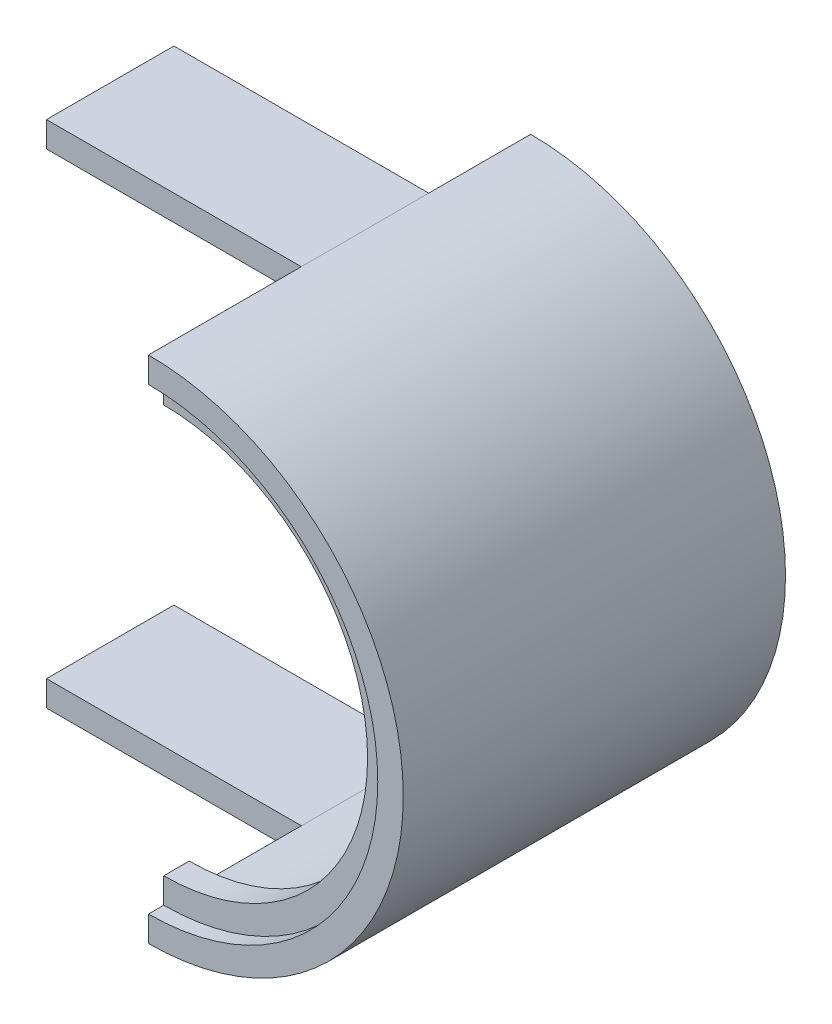
ISO-10303-21;
HEADER;
FILE_DESCRIPTION(('STEP AP214'),'2;1');
FILE_NAME('part.step','',(''),(''),'','','');
FILE_SCHEMA(('AUTOMOTIVE_DESIGN { 1 0 10303 214 1 1 1 1 }'));
ENDSEC;
DATA;
#1=APPLICATION_CONTEXT('core data for automotive mechanical design processes');
#2=APPLICATION_PROTOCOL_DEFINITION('international standard','automotive_design',2000,#1);
#3=PRODUCT_CONTEXT('',#1,'mechanical');
#4=PRODUCT('Part','Part','',(#3));
#5=PRODUCT_RELATED_PRODUCT_CATEGORY('part','',(#4));
#6=PRODUCT_DEFINITION_FORMATION('','',#4);
#7=PRODUCT_DEFINITION_CONTEXT('part definition',#1,'design');
#8=PRODUCT_DEFINITION('design','',#6,#7);
#9=PRODUCT_DEFINITION_SHAPE('','',#8);
#10=(LENGTH_UNIT() NAMED_UNIT(*) SI_UNIT(.MILLI.,.METRE.));
#11=(NAMED_UNIT(*) PLANE_ANGLE_UNIT() SI_UNIT($,.RADIAN.));
#12=(NAMED_UNIT(*) SI_UNIT($,.STERADIAN.) SOLID_ANGLE_UNIT());
#13=UNCERTAINTY_MEASURE_WITH_UNIT(LENGTH_MEASURE(1.E-05),#10,'distance_accuracy_value','');
#14=(GEOMETRIC_REPRESENTATION_CONTEXT(3) GLOBAL_UNCERTAINTY_ASSIGNED_CONTEXT((#13)) GLOBAL_UNIT_ASSIGNED_CONTEXT((#10,
#11,#12)) REPRESENTATION_CONTEXT('',''));
#15=CARTESIAN_POINT('',(0.,0.,0.));
#16=DIRECTION('',(0.,0.,1.));
#17=DIRECTION('',(1.,0.,0.));
#18=AXIS2_PLACEMENT_3D('',#15,#16,#17);
#19=CARTESIAN_POINT('',(597.266258042068,0.,0.));
#20=DIRECTION('',(1.,0.,0.));
#21=DIRECTION('',(0.,0.,-1.));
#22=AXIS2_PLACEMENT_3D('',#19,#20,#21);
#23=PLANE('',#22);
#24=DIRECTION('',(0.,-1.,0.));
#25=VECTOR('',#24,1.);
#26=CARTESIAN_POINT('',(597.266258042068,50.,25.));
#27=LINE('',#26,#25);
#28=CARTESIAN_POINT('',(597.266258042068,50.,25.));
#29=VERTEX_POINT('',#28);
#30=CARTESIAN_POINT('',(597.266258042068,45.,25.));
#31=VERTEX_POINT('',#30);
#32=EDGE_CURVE('E56',#29,#31,#27,.T.);
#33=ORIENTED_EDGE('',*,*,#32,.F.);
#34=DIRECTION('',(0.,0.,-1.));
#35=VECTOR('',#34,1.);
#36=CARTESIAN_POINT('',(597.266258042068,50.,80.));
#37=LINE('',#36,#35);
#38=CARTESIAN_POINT('',(597.266258042068,50.,5.));
#39=VERTEX_POINT('',#38);
#40=EDGE_CURVE('E48',#29,#39,#37,.T.);
#41=ORIENTED_EDGE('',*,*,#40,.T.);
#42=DIRECTION('',(0.,-1.,0.));
#43=VECTOR('',#42,1.);
#44=CARTESIAN_POINT('',(597.266258042068,0.,5.));
#45=LINE('',#44,#43);
#46=CARTESIAN_POINT('',(597.266258042068,45.,5.));
#47=VERTEX_POINT('',#46);
#48=EDGE_CURVE('E220',#39,#47,#45,.T.);
#49=ORIENTED_EDGE('',*,*,#48,.T.);
#50=DIRECTION('',(0.,0.,-1.));
#51=VECTOR('',#50,1.);
#52=CARTESIAN_POINT('',(597.266258042068,45.,80.));
#53=LINE('',#52,#51);
#54=EDGE_CURVE('E233',#31,#47,#53,.T.);
#55=ORIENTED_EDGE('',*,*,#54,.F.);
#56=EDGE_LOOP('',(#33,#41,#49,#55));
#57=FACE_BOUND('',#56,.T.);
#58=ADVANCED_FACE('F39',(#57),#23,.F.);
#59=DIRECTION('',(0.,1.,0.));
#60=VECTOR('',#59,1.);
#61=CARTESIAN_POINT('',(597.266258042068,50.,50.));
#62=LINE('',#61,#60);
#63=CARTESIAN_POINT('',(597.266258042068,45.,50.));
#64=VERTEX_POINT('',#63);
#65=CARTESIAN_POINT('',(597.266258042068,50.,50.));
#66=VERTEX_POINT('',#65);
#67=EDGE_CURVE('E283',#64,#66,#62,.T.);
#68=ORIENTED_EDGE('',*,*,#67,.F.);
#69=CARTESIAN_POINT('',(597.266258042068,45.,72.));
#70=VERTEX_POINT('',#69);
#71=EDGE_CURVE('E229',#70,#64,#53,.T.);
#72=ORIENTED_EDGE('',*,*,#71,.F.);
#73=DIRECTION('',(0.,-1.,0.));
#74=VECTOR('',#73,1.);
#75=CARTESIAN_POINT('',(597.266258042068,0.,72.));
#76=LINE('',#75,#74);
#77=CARTESIAN_POINT('',(597.266258042068,40.,72.));
#78=VERTEX_POINT('',#77);
#79=EDGE_CURVE('E232',#70,#78,#76,.T.);
#80=ORIENTED_EDGE('',*,*,#79,.T.);
#81=DIRECTION('',(0.,0.,1.));
#82=VECTOR('',#81,1.);
#83=CARTESIAN_POINT('',(597.266258042068,40.,4.99000000000001));
#84=LINE('',#83,#82);
#85=CARTESIAN_POINT('',(597.266258042068,40.,77.));
#86=VERTEX_POINT('',#85);
#87=EDGE_CURVE('E242',#86,#78,#84,.F.);
#88=ORIENTED_EDGE('',*,*,#87,.F.);
#89=DIRECTION('',(0.,-1.,0.));
#90=VECTOR('',#89,1.);
#91=CARTESIAN_POINT('',(597.266258042068,0.,77.));
#92=LINE('',#91,#90);
#93=CARTESIAN_POINT('',(597.266258042068,45.,77.));
#94=VERTEX_POINT('',#93);
#95=EDGE_CURVE('E249',#94,#86,#92,.T.);
#96=ORIENTED_EDGE('',*,*,#95,.F.);
#97=DIRECTION('',(0.,0.,-1.));
#98=VECTOR('',#97,1.);
#99=CARTESIAN_POINT('',(597.266258042068,45.,80.));
#100=LINE('',#99,#98);
#101=CARTESIAN_POINT('',(597.266258042068,45.,80.));
#102=VERTEX_POINT('',#101);
#103=EDGE_CURVE('E260',#102,#94,#100,.T.);
#104=ORIENTED_EDGE('',*,*,#103,.F.);
#105=DIRECTION('',(0.,1.,0.));
#106=VECTOR('',#105,1.);
#107=CARTESIAN_POINT('',(597.266258042068,0.,80.));
#108=LINE('',#107,#106);
#109=CARTESIAN_POINT('',(597.266258042068,50.,80.));
#110=VERTEX_POINT('',#109);
#111=EDGE_CURVE('E252',#102,#110,#108,.T.);
#112=ORIENTED_EDGE('',*,*,#111,.T.);
#113=EDGE_CURVE('E12',#110,#66,#37,.T.);
#114=ORIENTED_EDGE('',*,*,#113,.T.);
#115=EDGE_LOOP('',(#68,#72,#80,#88,#96,#104,#112,#114));
#116=FACE_BOUND('',#115,.T.);
#117=ADVANCED_FACE('F287',(#116),#23,.F.);
#118=DIRECTION('',(0.,-1.,0.));
#119=VECTOR('',#118,1.);
#120=CARTESIAN_POINT('',(597.266258042068,-45.,25.));
#121=LINE('',#120,#119);
#122=CARTESIAN_POINT('',(597.266258042068,-45.,25.));
#123=VERTEX_POINT('',#122);
#124=CARTESIAN_POINT('',(597.266258042068,-50.,25.));
#125=VERTEX_POINT('',#124);
#126=EDGE_CURVE('E176',#123,#125,#121,.T.);
#127=ORIENTED_EDGE('',*,*,#126,.F.);
#128=DIRECTION('',(0.,0.,-1.));
#129=VECTOR('',#128,1.);
#130=CARTESIAN_POINT('',(597.266258042068,-45.,80.));
#131=LINE('',#130,#129);
#132=CARTESIAN_POINT('',(597.266258042068,-45.,5.));
#133=VERTEX_POINT('',#132);
#134=EDGE_CURVE('E218',#123,#133,#131,.T.);
#135=ORIENTED_EDGE('',*,*,#134,.T.);
#136=CARTESIAN_POINT('',(597.266258042068,-50.,5.));
#137=VERTEX_POINT('',#136);
#138=EDGE_CURVE('E219',#133,#137,#45,.T.);
#139=ORIENTED_EDGE('',*,*,#138,.T.);
#140=DIRECTION('',(0.,0.,-1.));
#141=VECTOR('',#140,1.);
#142=CARTESIAN_POINT('',(597.266258042068,-50.,80.));
#143=LINE('',#142,#141);
#144=EDGE_CURVE('E64',#125,#137,#143,.T.);
#145=ORIENTED_EDGE('',*,*,#144,.F.);
#146=EDGE_LOOP('',(#127,#135,#139,#145));
#147=FACE_BOUND('',#146,.T.);
#148=ADVANCED_FACE('F41',(#147),#23,.F.);
#149=DIRECTION('',(0.,1.,0.));
#150=VECTOR('',#149,1.);
#151=CARTESIAN_POINT('',(597.266258042068,-45.,50.));
#152=LINE('',#151,#150);
#153=CARTESIAN_POINT('',(597.266258042068,-50.,50.));
#154=VERTEX_POINT('',#153);
#155=CARTESIAN_POINT('',(597.266258042068,-45.,50.));
#156=VERTEX_POINT('',#155);
#157=EDGE_CURVE('E198',#154,#156,#152,.T.);
#158=ORIENTED_EDGE('',*,*,#157,.F.);
#159=CARTESIAN_POINT('',(597.266258042068,-50.,80.));
#160=VERTEX_POINT('',#159);
#161=EDGE_CURVE('E266',#160,#154,#143,.T.);
#162=ORIENTED_EDGE('',*,*,#161,.F.);
#163=CARTESIAN_POINT('',(597.266258042068,-45.,80.));
#164=VERTEX_POINT('',#163);
#165=EDGE_CURVE('E255',#160,#164,#108,.T.);
#166=ORIENTED_EDGE('',*,*,#165,.T.);
#167=DIRECTION('',(0.,0.,-1.));
#168=VECTOR('',#167,1.);
#169=CARTESIAN_POINT('',(597.266258042068,-45.,80.));
#170=LINE('',#169,#168);
#171=CARTESIAN_POINT('',(597.266258042068,-45.,77.));
#172=VERTEX_POINT('',#171);
#173=EDGE_CURVE('E256',#164,#172,#170,.T.);
#174=ORIENTED_EDGE('',*,*,#173,.T.);
#175=CARTESIAN_POINT('',(597.266258042068,-40.,77.));
#176=VERTEX_POINT('',#175);
#177=EDGE_CURVE('E251',#176,#172,#92,.T.);
#178=ORIENTED_EDGE('',*,*,#177,.F.);
#179=DIRECTION('',(0.,0.,1.));
#180=VECTOR('',#179,1.);
#181=CARTESIAN_POINT('',(597.266258042068,-40.,4.99000000000001));
#182=LINE('',#181,#180);
#183=CARTESIAN_POINT('',(597.266258042068,-40.,72.));
#184=VERTEX_POINT('',#183);
#185=EDGE_CURVE('E214',#184,#176,#182,.T.);
#186=ORIENTED_EDGE('',*,*,#185,.F.);
#187=CARTESIAN_POINT('',(597.266258042068,-45.,72.));
#188=VERTEX_POINT('',#187);
#189=EDGE_CURVE('E248',#184,#188,#76,.T.);
#190=ORIENTED_EDGE('',*,*,#189,.T.);
#191=EDGE_CURVE('E234',#188,#156,#131,.T.);
#192=ORIENTED_EDGE('',*,*,#191,.T.);
#193=EDGE_LOOP('',(#158,#162,#166,#174,#178,#186,#190,#192));
#194=FACE_BOUND('',#193,.T.);
#195=ADVANCED_FACE('F297',(#194),#23,.F.);
#196=CARTESIAN_POINT('',(-502.733741957931,0.,80.));
#197=DIRECTION('',(0.,0.,1.));
#198=DIRECTION('',(1.,0.,0.));
#199=AXIS2_PLACEMENT_3D('',#196,#197,#198);
#200=PLANE('',#199);
#201=ORIENTED_EDGE('',*,*,#165,.F.);
#202=CARTESIAN_POINT('',(597.266258042068,0.,80.));
#203=DIRECTION('',(0.,0.,1.));
#204=DIRECTION('',(1.,0.,0.));
#205=AXIS2_PLACEMENT_3D('',#202,#203,#204);
#206=CIRCLE('',#205,50.);
#207=EDGE_CURVE('E257',#160,#110,#206,.T.);
#208=ORIENTED_EDGE('',*,*,#207,.T.);
#209=ORIENTED_EDGE('',*,*,#111,.F.);
#210=CARTESIAN_POINT('',(597.266258042068,0.,80.));
#211=DIRECTION('',(0.,0.,1.));
#212=DIRECTION('',(1.,0.,0.));
#213=AXIS2_PLACEMENT_3D('',#210,#211,#212);
#214=CIRCLE('',#213,45.);
#215=EDGE_CURVE('E261',#164,#102,#214,.T.);
#216=ORIENTED_EDGE('',*,*,#215,.F.);
#217=EDGE_LOOP('',(#201,#208,#209,#216));
#218=FACE_BOUND('',#217,.T.);
#219=ADVANCED_FACE('F294',(#218),#200,.T.);
#220=CARTESIAN_POINT('',(597.266258042068,0.,80.));
#221=DIRECTION('',(0.,0.,-1.));
#222=DIRECTION('',(-1.,0.,0.));
#223=AXIS2_PLACEMENT_3D('',#220,#221,#222);
#224=CYLINDRICAL_SURFACE('',#223,50.);
#225=ORIENTED_EDGE('',*,*,#161,.T.);
#226=DIRECTION('',(0.,0.,1.));
#227=VECTOR('',#226,1.);
#228=CARTESIAN_POINT('',(597.266258042068,-50.,25.));
#229=LINE('',#228,#227);
#230=EDGE_CURVE('E179',#125,#154,#229,.T.);
#231=ORIENTED_EDGE('',*,*,#230,.F.);
#232=ORIENTED_EDGE('',*,*,#144,.T.);
#233=CARTESIAN_POINT('',(597.266258042068,0.,5.));
#234=DIRECTION('',(0.,0.,1.));
#235=DIRECTION('',(1.,0.,0.));
#236=AXIS2_PLACEMENT_3D('',#233,#234,#235);
#237=CIRCLE('',#236,50.);
#238=EDGE_CURVE('E215',#137,#39,#237,.T.);
#239=ORIENTED_EDGE('',*,*,#238,.T.);
#240=ORIENTED_EDGE('',*,*,#40,.F.);
#241=DIRECTION('',(0.,0.,-1.));
#242=VECTOR('',#241,1.);
#243=CARTESIAN_POINT('',(597.266258042068,50.,25.));
#244=LINE('',#243,#242);
#245=EDGE_CURVE('E173',#66,#29,#244,.T.);
#246=ORIENTED_EDGE('',*,*,#245,.F.);
#247=ORIENTED_EDGE('',*,*,#113,.F.);
#248=ORIENTED_EDGE('',*,*,#207,.F.);
#249=EDGE_LOOP('',(#225,#231,#232,#239,#240,#246,#247,#248));
#250=FACE_BOUND('',#249,.T.);
#251=ADVANCED_FACE('F270',(#250),#224,.T.);
#252=CARTESIAN_POINT('',(597.266258042068,0.,80.));
#253=DIRECTION('',(0.,0.,-1.));
#254=DIRECTION('',(-1.,0.,0.));
#255=AXIS2_PLACEMENT_3D('',#252,#253,#254);
#256=CYLINDRICAL_SURFACE('',#255,45.);
#257=CARTESIAN_POINT('',(597.266258042068,0.,77.));
#258=DIRECTION('',(0.,0.,1.));
#259=DIRECTION('',(1.,0.,0.));
#260=AXIS2_PLACEMENT_3D('',#257,#258,#259);
#261=CIRCLE('',#260,45.);
#262=EDGE_CURVE('E43',#172,#94,#261,.T.);
#263=ORIENTED_EDGE('',*,*,#262,.F.);
#264=ORIENTED_EDGE('',*,*,#173,.F.);
#265=ORIENTED_EDGE('',*,*,#215,.T.);
#266=ORIENTED_EDGE('',*,*,#103,.T.);
#267=EDGE_LOOP('',(#263,#264,#265,#266));
#268=FACE_BOUND('',#267,.T.);
#269=ADVANCED_FACE('F342',(#268),#256,.F.);
#270=CARTESIAN_POINT('',(597.266258042068,-45.,77.));
#271=DIRECTION('',(0.,0.,1.));
#272=DIRECTION('',(1.,0.,0.));
#273=AXIS2_PLACEMENT_3D('',#270,#271,#272);
#274=PLANE('',#273);
#275=ORIENTED_EDGE('',*,*,#177,.T.);
#276=ORIENTED_EDGE('',*,*,#262,.T.);
#277=ORIENTED_EDGE('',*,*,#95,.T.);
#278=CARTESIAN_POINT('',(597.266258042068,0.,77.));
#279=DIRECTION('',(0.,0.,1.));
#280=DIRECTION('',(1.,0.,0.));
#281=AXIS2_PLACEMENT_3D('',#278,#279,#280);
#282=CIRCLE('',#281,40.);
#283=EDGE_CURVE('E228',#86,#176,#282,.F.);
#284=ORIENTED_EDGE('',*,*,#283,.T.);
#285=EDGE_LOOP('',(#275,#276,#277,#284));
#286=FACE_BOUND('',#285,.T.);
#287=ADVANCED_FACE('F331',(#286),#274,.T.);
#288=CARTESIAN_POINT('',(597.266258042068,0.,4.99000000000001));
#289=DIRECTION('',(0.,0.,1.));
#290=DIRECTION('',(1.,0.,0.));
#291=AXIS2_PLACEMENT_3D('',#288,#289,#290);
#292=CYLINDRICAL_SURFACE('',#291,40.);
#293=ORIENTED_EDGE('',*,*,#87,.T.);
#294=CARTESIAN_POINT('',(597.266258042068,0.,72.));
#295=DIRECTION('',(0.,0.,1.));
#296=DIRECTION('',(1.,0.,0.));
#297=AXIS2_PLACEMENT_3D('',#294,#295,#296);
#298=CIRCLE('',#297,40.);
#299=EDGE_CURVE('E239',#78,#184,#298,.F.);
#300=ORIENTED_EDGE('',*,*,#299,.T.);
#301=ORIENTED_EDGE('',*,*,#185,.T.);
#302=ORIENTED_EDGE('',*,*,#283,.F.);
#303=EDGE_LOOP('',(#293,#300,#301,#302));
#304=FACE_BOUND('',#303,.T.);
#305=ADVANCED_FACE('F320',(#304),#292,.F.);
#306=CARTESIAN_POINT('',(597.266258042068,-45.,5.));
#307=DIRECTION('',(0.,0.,1.));
#308=DIRECTION('',(1.,0.,0.));
#309=AXIS2_PLACEMENT_3D('',#306,#307,#308);
#310=PLANE('',#309);
#311=ORIENTED_EDGE('',*,*,#238,.F.);
#312=ORIENTED_EDGE('',*,*,#138,.F.);
#313=CARTESIAN_POINT('',(597.266258042068,0.,5.));
#314=DIRECTION('',(0.,0.,1.));
#315=DIRECTION('',(1.,0.,0.));
#316=AXIS2_PLACEMENT_3D('',#313,#314,#315);
#317=CIRCLE('',#316,45.);
#318=EDGE_CURVE('E223',#133,#47,#317,.T.);
#319=ORIENTED_EDGE('',*,*,#318,.T.);
#320=ORIENTED_EDGE('',*,*,#48,.F.);
#321=EDGE_LOOP('',(#311,#312,#319,#320));
#322=FACE_BOUND('',#321,.T.);
#323=ADVANCED_FACE('F277',(#322),#310,.F.);
#324=CARTESIAN_POINT('',(597.266258042068,0.,80.));
#325=DIRECTION('',(0.,0.,-1.));
#326=DIRECTION('',(-1.,0.,0.));
#327=AXIS2_PLACEMENT_3D('',#324,#325,#326);
#328=CYLINDRICAL_SURFACE('',#327,45.);
#329=ORIENTED_EDGE('',*,*,#191,.F.);
#330=CARTESIAN_POINT('',(597.266258042068,0.,72.));
#331=DIRECTION('',(0.,0.,1.));
#332=DIRECTION('',(1.,0.,0.));
#333=AXIS2_PLACEMENT_3D('',#330,#331,#332);
#334=CIRCLE('',#333,45.);
#335=EDGE_CURVE('E226',#188,#70,#334,.T.);
#336=ORIENTED_EDGE('',*,*,#335,.T.);
#337=ORIENTED_EDGE('',*,*,#71,.T.);
#338=DIRECTION('',(0.,0.,1.));
#339=VECTOR('',#338,1.);
#340=CARTESIAN_POINT('',(597.266258042068,45.,25.));
#341=LINE('',#340,#339);
#342=EDGE_CURVE('E552',#31,#64,#341,.T.);
#343=ORIENTED_EDGE('',*,*,#342,.F.);
#344=ORIENTED_EDGE('',*,*,#54,.T.);
#345=ORIENTED_EDGE('',*,*,#318,.F.);
#346=ORIENTED_EDGE('',*,*,#134,.F.);
#347=DIRECTION('',(0.,0.,-1.));
#348=VECTOR('',#347,1.);
#349=CARTESIAN_POINT('',(597.266258042068,-45.,25.));
#350=LINE('',#349,#348);
#351=EDGE_CURVE('E189',#156,#123,#350,.T.);
#352=ORIENTED_EDGE('',*,*,#351,.F.);
#353=EDGE_LOOP('',(#329,#336,#337,#343,#344,#345,#346,#352));
#354=FACE_BOUND('',#353,.T.);
#355=ADVANCED_FACE('F326',(#354),#328,.F.);
#356=CARTESIAN_POINT('',(0.,0.,72.));
#357=DIRECTION('',(0.,0.,1.));
#358=DIRECTION('',(1.,0.,0.));
#359=AXIS2_PLACEMENT_3D('',#356,#357,#358);
#360=PLANE('',#359);
#361=ORIENTED_EDGE('',*,*,#299,.F.);
#362=ORIENTED_EDGE('',*,*,#79,.F.);
#363=ORIENTED_EDGE('',*,*,#335,.F.);
#364=ORIENTED_EDGE('',*,*,#189,.F.);
#365=EDGE_LOOP('',(#361,#362,#363,#364));
#366=FACE_BOUND('',#365,.T.);
#367=ADVANCED_FACE('F318',(#366),#360,.F.);
#368=CARTESIAN_POINT('',(547.266258042068,-45.,25.));
#369=DIRECTION('',(0.,0.,1.));
#370=DIRECTION('',(1.,0.,0.));
#371=AXIS2_PLACEMENT_3D('',#368,#369,#370);
#372=PLANE('',#371);
#373=ORIENTED_EDGE('',*,*,#126,.T.);
#374=DIRECTION('',(1.,0.,0.));
#375=VECTOR('',#374,1.);
#376=CARTESIAN_POINT('',(547.266258042068,-50.,25.));
#377=LINE('',#376,#375);
#378=CARTESIAN_POINT('',(547.266258042068,-50.,25.));
#379=VERTEX_POINT('',#378);
#380=EDGE_CURVE('E211',#379,#125,#377,.T.);
#381=ORIENTED_EDGE('',*,*,#380,.F.);
#382=DIRECTION('',(0.,-1.,0.));
#383=VECTOR('',#382,1.);
#384=CARTESIAN_POINT('',(547.266258042068,-45.,25.));
#385=LINE('',#384,#383);
#386=CARTESIAN_POINT('',(547.266258042068,-45.,25.));
#387=VERTEX_POINT('',#386);
#388=EDGE_CURVE('E185',#387,#379,#385,.T.);
#389=ORIENTED_EDGE('',*,*,#388,.F.);
#390=DIRECTION('',(1.,0.,0.));
#391=VECTOR('',#390,1.);
#392=CARTESIAN_POINT('',(547.266258042068,-45.,25.));
#393=LINE('',#392,#391);
#394=EDGE_CURVE('E194',#387,#123,#393,.T.);
#395=ORIENTED_EDGE('',*,*,#394,.T.);
#396=EDGE_LOOP('',(#373,#381,#389,#395));
#397=FACE_BOUND('',#396,.T.);
#398=ADVANCED_FACE('F316',(#397),#372,.F.);
#399=CARTESIAN_POINT('',(547.266258042068,-50.,25.));
#400=DIRECTION('',(0.,1.,0.));
#401=DIRECTION('',(0.,0.,1.));
#402=AXIS2_PLACEMENT_3D('',#399,#400,#401);
#403=PLANE('',#402);
#404=ORIENTED_EDGE('',*,*,#230,.T.);
#405=DIRECTION('',(1.,0.,0.));
#406=VECTOR('',#405,1.);
#407=CARTESIAN_POINT('',(547.266258042068,-50.,50.));
#408=LINE('',#407,#406);
#409=CARTESIAN_POINT('',(547.266258042068,-50.,50.));
#410=VERTEX_POINT('',#409);
#411=EDGE_CURVE('E208',#410,#154,#408,.T.);
#412=ORIENTED_EDGE('',*,*,#411,.F.);
#413=DIRECTION('',(0.,0.,1.));
#414=VECTOR('',#413,1.);
#415=CARTESIAN_POINT('',(547.266258042068,-50.,25.));
#416=LINE('',#415,#414);
#417=EDGE_CURVE('E188',#379,#410,#416,.T.);
#418=ORIENTED_EDGE('',*,*,#417,.F.);
#419=ORIENTED_EDGE('',*,*,#380,.T.);
#420=EDGE_LOOP('',(#404,#412,#418,#419));
#421=FACE_BOUND('',#420,.T.);
#422=ADVANCED_FACE('F314',(#421),#403,.F.);
#423=CARTESIAN_POINT('',(547.266258042068,-45.,50.));
#424=DIRECTION('',(0.,0.,-1.));
#425=DIRECTION('',(-1.,0.,0.));
#426=AXIS2_PLACEMENT_3D('',#423,#424,#425);
#427=PLANE('',#426);
#428=ORIENTED_EDGE('',*,*,#157,.T.);
#429=DIRECTION('',(1.,0.,0.));
#430=VECTOR('',#429,1.);
#431=CARTESIAN_POINT('',(547.266258042068,-45.,50.));
#432=LINE('',#431,#430);
#433=CARTESIAN_POINT('',(547.266258042068,-45.,50.));
#434=VERTEX_POINT('',#433);
#435=EDGE_CURVE('E205',#434,#156,#432,.T.);
#436=ORIENTED_EDGE('',*,*,#435,.F.);
#437=DIRECTION('',(0.,1.,0.));
#438=VECTOR('',#437,1.);
#439=CARTESIAN_POINT('',(547.266258042068,-45.,50.));
#440=LINE('',#439,#438);
#441=EDGE_CURVE('E191',#410,#434,#440,.T.);
#442=ORIENTED_EDGE('',*,*,#441,.F.);
#443=ORIENTED_EDGE('',*,*,#411,.T.);
#444=EDGE_LOOP('',(#428,#436,#442,#443));
#445=FACE_BOUND('',#444,.T.);
#446=ADVANCED_FACE('F302',(#445),#427,.F.);
#447=CARTESIAN_POINT('',(547.266258042068,-45.,25.));
#448=DIRECTION('',(0.,-1.,0.));
#449=DIRECTION('',(0.,0.,-1.));
#450=AXIS2_PLACEMENT_3D('',#447,#448,#449);
#451=PLANE('',#450);
#452=ORIENTED_EDGE('',*,*,#351,.T.);
#453=ORIENTED_EDGE('',*,*,#394,.F.);
#454=DIRECTION('',(0.,0.,-1.));
#455=VECTOR('',#454,1.);
#456=CARTESIAN_POINT('',(547.266258042068,-45.,25.));
#457=LINE('',#456,#455);
#458=EDGE_CURVE('E193',#434,#387,#457,.T.);
#459=ORIENTED_EDGE('',*,*,#458,.F.);
#460=ORIENTED_EDGE('',*,*,#435,.T.);
#461=EDGE_LOOP('',(#452,#453,#459,#460));
#462=FACE_BOUND('',#461,.T.);
#463=ADVANCED_FACE('F307',(#462),#451,.F.);
#464=CARTESIAN_POINT('',(547.266258042068,0.,0.));
#465=DIRECTION('',(-1.,0.,0.));
#466=DIRECTION('',(0.,0.,1.));
#467=AXIS2_PLACEMENT_3D('',#464,#465,#466);
#468=PLANE('',#467);
#469=ORIENTED_EDGE('',*,*,#388,.T.);
#470=ORIENTED_EDGE('',*,*,#417,.T.);
#471=ORIENTED_EDGE('',*,*,#441,.T.);
#472=ORIENTED_EDGE('',*,*,#458,.T.);
#473=EDGE_LOOP('',(#469,#470,#471,#472));
#474=FACE_BOUND('',#473,.T.);
#475=ADVANCED_FACE('F311',(#474),#468,.T.);
#476=CARTESIAN_POINT('',(547.266258042068,50.,25.));
#477=DIRECTION('',(0.,0.,1.));
#478=DIRECTION('',(0.,-1.,0.));
#479=AXIS2_PLACEMENT_3D('',#476,#477,#478);
#480=PLANE('',#479);
#481=ORIENTED_EDGE('',*,*,#32,.T.);
#482=DIRECTION('',(1.,0.,0.));
#483=VECTOR('',#482,1.);
#484=CARTESIAN_POINT('',(547.266258042068,45.,25.));
#485=LINE('',#484,#483);
#486=CARTESIAN_POINT('',(547.266258042068,45.,25.));
#487=VERTEX_POINT('',#486);
#488=EDGE_CURVE('E159',#487,#31,#485,.T.);
#489=ORIENTED_EDGE('',*,*,#488,.F.);
#490=DIRECTION('',(0.,-1.,0.));
#491=VECTOR('',#490,1.);
#492=CARTESIAN_POINT('',(547.266258042068,50.,25.));
#493=LINE('',#492,#491);
#494=CARTESIAN_POINT('',(547.266258042068,50.,25.));
#495=VERTEX_POINT('',#494);
#496=EDGE_CURVE('E166',#495,#487,#493,.T.);
#497=ORIENTED_EDGE('',*,*,#496,.F.);
#498=DIRECTION('',(1.,0.,0.));
#499=VECTOR('',#498,1.);
#500=CARTESIAN_POINT('',(547.266258042068,50.,25.));
#501=LINE('',#500,#499);
#502=EDGE_CURVE('E554',#495,#29,#501,.T.);
#503=ORIENTED_EDGE('',*,*,#502,.T.);
#504=EDGE_LOOP('',(#481,#489,#497,#503));
#505=FACE_BOUND('',#504,.T.);
#506=ADVANCED_FACE('F175',(#505),#480,.F.);
#507=CARTESIAN_POINT('',(547.266258042068,45.,25.));
#508=DIRECTION('',(0.,1.,0.));
#509=DIRECTION('',(0.,0.,1.));
#510=AXIS2_PLACEMENT_3D('',#507,#508,#509);
#511=PLANE('',#510);
#512=ORIENTED_EDGE('',*,*,#342,.T.);
#513=DIRECTION('',(1.,0.,0.));
#514=VECTOR('',#513,1.);
#515=CARTESIAN_POINT('',(547.266258042068,45.,50.));
#516=LINE('',#515,#514);
#517=CARTESIAN_POINT('',(547.266258042068,45.,50.));
#518=VERTEX_POINT('',#517);
#519=EDGE_CURVE('E162',#518,#64,#516,.T.);
#520=ORIENTED_EDGE('',*,*,#519,.F.);
#521=DIRECTION('',(0.,0.,1.));
#522=VECTOR('',#521,1.);
#523=CARTESIAN_POINT('',(547.266258042068,45.,25.));
#524=LINE('',#523,#522);
#525=EDGE_CURVE('E156',#487,#518,#524,.T.);
#526=ORIENTED_EDGE('',*,*,#525,.F.);
#527=ORIENTED_EDGE('',*,*,#488,.T.);
#528=EDGE_LOOP('',(#512,#520,#526,#527));
#529=FACE_BOUND('',#528,.T.);
#530=ADVANCED_FACE('F158',(#529),#511,.F.);
#531=CARTESIAN_POINT('',(547.266258042068,50.,50.));
#532=DIRECTION('',(0.,0.,-1.));
#533=DIRECTION('',(-1.,0.,0.));
#534=AXIS2_PLACEMENT_3D('',#531,#532,#533);
#535=PLANE('',#534);
#536=ORIENTED_EDGE('',*,*,#67,.T.);
#537=DIRECTION('',(1.,0.,0.));
#538=VECTOR('',#537,1.);
#539=CARTESIAN_POINT('',(547.266258042068,50.,50.));
#540=LINE('',#539,#538);
#541=CARTESIAN_POINT('',(547.266258042068,50.,50.));
#542=VERTEX_POINT('',#541);
#543=EDGE_CURVE('E181',#542,#66,#540,.T.);
#544=ORIENTED_EDGE('',*,*,#543,.F.);
#545=DIRECTION('',(0.,1.,0.));
#546=VECTOR('',#545,1.);
#547=CARTESIAN_POINT('',(547.266258042068,50.,50.));
#548=LINE('',#547,#546);
#549=EDGE_CURVE('E165',#518,#542,#548,.T.);
#550=ORIENTED_EDGE('',*,*,#549,.F.);
#551=ORIENTED_EDGE('',*,*,#519,.T.);
#552=EDGE_LOOP('',(#536,#544,#550,#551));
#553=FACE_BOUND('',#552,.T.);
#554=ADVANCED_FACE('F515',(#553),#535,.F.);
#555=CARTESIAN_POINT('',(547.266258042068,50.,25.));
#556=DIRECTION('',(0.,-1.,0.));
#557=DIRECTION('',(0.,0.,-1.));
#558=AXIS2_PLACEMENT_3D('',#555,#556,#557);
#559=PLANE('',#558);
#560=ORIENTED_EDGE('',*,*,#245,.T.);
#561=ORIENTED_EDGE('',*,*,#502,.F.);
#562=DIRECTION('',(0.,0.,-1.));
#563=VECTOR('',#562,1.);
#564=CARTESIAN_POINT('',(547.266258042068,50.,25.));
#565=LINE('',#564,#563);
#566=EDGE_CURVE('E171',#542,#495,#565,.T.);
#567=ORIENTED_EDGE('',*,*,#566,.F.);
#568=ORIENTED_EDGE('',*,*,#543,.T.);
#569=EDGE_LOOP('',(#560,#561,#567,#568));
#570=FACE_BOUND('',#569,.T.);
#571=ADVANCED_FACE('F518',(#570),#559,.F.);
#572=CARTESIAN_POINT('',(547.266258042068,0.,0.));
#573=DIRECTION('',(-1.,0.,0.));
#574=DIRECTION('',(0.,0.,1.));
#575=AXIS2_PLACEMENT_3D('',#572,#573,#574);
#576=PLANE('',#575);
#577=ORIENTED_EDGE('',*,*,#496,.T.);
#578=ORIENTED_EDGE('',*,*,#525,.T.);
#579=ORIENTED_EDGE('',*,*,#549,.T.);
#580=ORIENTED_EDGE('',*,*,#566,.T.);
#581=EDGE_LOOP('',(#577,#578,#579,#580));
#582=FACE_BOUND('',#581,.T.);
#583=ADVANCED_FACE('F169',(#582),#576,.T.);
#584=CLOSED_SHELL('',(#58,#117,#148,#195,#219,#251,#269,#287,#305,#323,#355,#367,#398,#422,#446,
#463,#475,#506,#530,#554,#571,#583));
#585=MANIFOLD_SOLID_BREP('B2',#584);
#586=ADVANCED_BREP_SHAPE_REPRESENTATION('',(#18,#585),#14);
#587=SHAPE_DEFINITION_REPRESENTATION(#9,#586);
ENDSEC;
END-ISO-10303-21;
